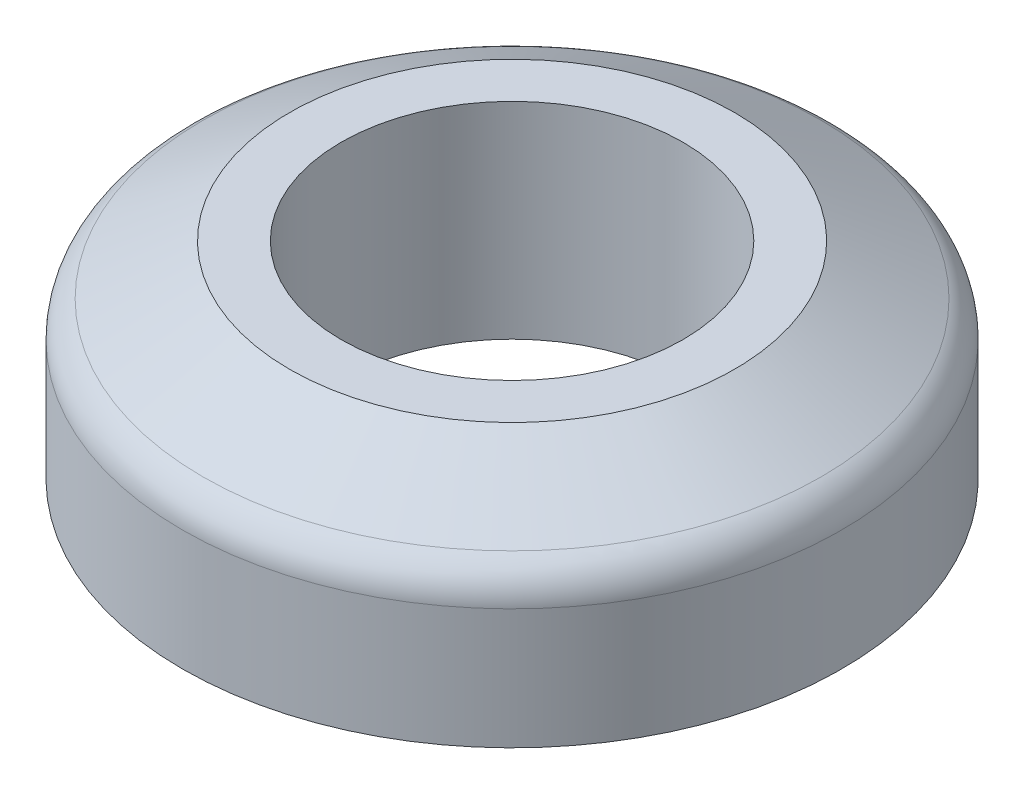
ISO-10303-21;
HEADER;
FILE_DESCRIPTION(('STEP AP214'),'2;1');
FILE_NAME('part.step','',(''),(''),'','','');
FILE_SCHEMA(('AUTOMOTIVE_DESIGN { 1 0 10303 214 1 1 1 1 }'));
ENDSEC;
DATA;
#1=APPLICATION_CONTEXT('core data for automotive mechanical design processes');
#2=APPLICATION_PROTOCOL_DEFINITION('international standard','automotive_design',2000,#1);
#3=PRODUCT_CONTEXT('',#1,'mechanical');
#4=PRODUCT('Part','Part','',(#3));
#5=PRODUCT_RELATED_PRODUCT_CATEGORY('part','',(#4));
#6=PRODUCT_DEFINITION_FORMATION('','',#4);
#7=PRODUCT_DEFINITION_CONTEXT('part definition',#1,'design');
#8=PRODUCT_DEFINITION('design','',#6,#7);
#9=PRODUCT_DEFINITION_SHAPE('','',#8);
#10=(LENGTH_UNIT() NAMED_UNIT(*) SI_UNIT(.MILLI.,.METRE.));
#11=(NAMED_UNIT(*) PLANE_ANGLE_UNIT() SI_UNIT($,.RADIAN.));
#12=(NAMED_UNIT(*) SI_UNIT($,.STERADIAN.) SOLID_ANGLE_UNIT());
#13=UNCERTAINTY_MEASURE_WITH_UNIT(LENGTH_MEASURE(1.E-05),#10,'distance_accuracy_value','');
#14=(GEOMETRIC_REPRESENTATION_CONTEXT(3) GLOBAL_UNCERTAINTY_ASSIGNED_CONTEXT((#13)) GLOBAL_UNIT_ASSIGNED_CONTEXT((#10,
#11,#12)) REPRESENTATION_CONTEXT('',''));
#15=CARTESIAN_POINT('',(0.,0.,0.));
#16=DIRECTION('',(0.,0.,1.));
#17=DIRECTION('',(1.,0.,0.));
#18=AXIS2_PLACEMENT_3D('',#15,#16,#17);
#19=CARTESIAN_POINT('',(0.,5.,0.));
#20=DIRECTION('',(0.,1.,0.));
#21=DIRECTION('',(0.,0.,1.));
#22=AXIS2_PLACEMENT_3D('',#19,#20,#21);
#23=PLANE('',#22);
#24=CARTESIAN_POINT('',(0.,5.,0.));
#25=DIRECTION('',(0.,1.,0.));
#26=DIRECTION('',(0.,0.,1.));
#27=AXIS2_PLACEMENT_3D('',#24,#25,#26);
#28=CIRCLE('',#27,5.39999999999998);
#29=CARTESIAN_POINT('',(0.,5.,5.39999999999998));
#30=VERTEX_POINT('',#29);
#31=EDGE_CURVE('E48',#30,#30,#28,.T.);
#32=ORIENTED_EDGE('',*,*,#31,.T.);
#33=EDGE_LOOP('',(#32));
#34=FACE_BOUND('',#33,.T.);
#35=CARTESIAN_POINT('',(0.,5.,0.));
#36=DIRECTION('',(0.,1.,0.));
#37=DIRECTION('',(0.,0.,1.));
#38=AXIS2_PLACEMENT_3D('',#35,#36,#37);
#39=CIRCLE('',#38,4.15);
#40=CARTESIAN_POINT('',(0.,5.,4.15));
#41=VERTEX_POINT('',#40);
#42=EDGE_CURVE('E57',#41,#41,#39,.T.);
#43=ORIENTED_EDGE('',*,*,#42,.F.);
#44=EDGE_LOOP('',(#43));
#45=FACE_BOUND('',#44,.T.);
#46=ADVANCED_FACE('F37',(#34,#45),#23,.T.);
#47=CARTESIAN_POINT('',(0.,0.,0.));
#48=DIRECTION('',(0.,1.,0.));
#49=DIRECTION('',(0.,0.,1.));
#50=AXIS2_PLACEMENT_3D('',#47,#48,#49);
#51=PLANE('',#50);
#52=CARTESIAN_POINT('',(0.,0.,0.));
#53=DIRECTION('',(0.,1.,0.));
#54=DIRECTION('',(0.,0.,1.));
#55=AXIS2_PLACEMENT_3D('',#52,#53,#54);
#56=CIRCLE('',#55,8.);
#57=CARTESIAN_POINT('',(0.,0.,8.));
#58=VERTEX_POINT('',#57);
#59=EDGE_CURVE('E52',#58,#58,#56,.T.);
#60=ORIENTED_EDGE('',*,*,#59,.F.);
#61=EDGE_LOOP('',(#60));
#62=FACE_BOUND('',#61,.T.);
#63=CARTESIAN_POINT('',(0.,0.,0.));
#64=DIRECTION('',(0.,1.,0.));
#65=DIRECTION('',(0.,0.,1.));
#66=AXIS2_PLACEMENT_3D('',#63,#64,#65);
#67=CIRCLE('',#66,4.15);
#68=CARTESIAN_POINT('',(0.,0.,4.15));
#69=VERTEX_POINT('',#68);
#70=EDGE_CURVE('E58',#69,#69,#67,.T.);
#71=ORIENTED_EDGE('',*,*,#70,.T.);
#72=EDGE_LOOP('',(#71));
#73=FACE_BOUND('',#72,.T.);
#74=ADVANCED_FACE('F68',(#62,#73),#51,.F.);
#75=CARTESIAN_POINT('',(0.,5.,0.));
#76=DIRECTION('',(0.,-1.,0.));
#77=DIRECTION('',(0.,0.,-1.));
#78=AXIS2_PLACEMENT_3D('',#75,#76,#77);
#79=CYLINDRICAL_SURFACE('',#78,8.);
#80=CARTESIAN_POINT('',(0.,2.92153903091734,0.));
#81=DIRECTION('',(0.,1.,0.));
#82=DIRECTION('',(0.,0.,1.));
#83=AXIS2_PLACEMENT_3D('',#80,#81,#82);
#84=CIRCLE('',#83,8.);
#85=CARTESIAN_POINT('',(0.,2.92153903091734,8.));
#86=VERTEX_POINT('',#85);
#87=EDGE_CURVE('E44',#86,#86,#84,.F.);
#88=ORIENTED_EDGE('',*,*,#87,.T.);
#89=EDGE_LOOP('',(#88));
#90=FACE_BOUND('',#89,.T.);
#91=ORIENTED_EDGE('',*,*,#59,.T.);
#92=EDGE_LOOP('',(#91));
#93=FACE_BOUND('',#92,.T.);
#94=ADVANCED_FACE('F74',(#90,#93),#79,.T.);
#95=CARTESIAN_POINT('',(0.,5.,0.));
#96=DIRECTION('',(0.,-1.,0.));
#97=DIRECTION('',(0.,0.,-1.));
#98=AXIS2_PLACEMENT_3D('',#95,#96,#97);
#99=CYLINDRICAL_SURFACE('',#98,4.15);
#100=ORIENTED_EDGE('',*,*,#42,.T.);
#101=EDGE_LOOP('',(#100));
#102=FACE_BOUND('',#101,.T.);
#103=ORIENTED_EDGE('',*,*,#70,.F.);
#104=EDGE_LOOP('',(#103));
#105=FACE_BOUND('',#104,.T.);
#106=ADVANCED_FACE('F64',(#102,#105),#99,.F.);
#107=CARTESIAN_POINT('',(0.,5.,0.));
#108=DIRECTION('',(0.,-1.,0.));
#109=DIRECTION('',(0.,0.,-1.));
#110=AXIS2_PLACEMENT_3D('',#107,#108,#109);
#111=CONICAL_SURFACE('',#110,5.39999999999998,1.0471975511966);
#112=CARTESIAN_POINT('',(0.,3.78756443470178,0.));
#113=DIRECTION('',(0.,-1.,0.));
#114=DIRECTION('',(0.,0.,-1.));
#115=AXIS2_PLACEMENT_3D('',#112,#113,#114);
#116=CIRCLE('',#115,7.5);
#117=CARTESIAN_POINT('',(0.,3.78756443470178,-7.5));
#118=VERTEX_POINT('',#117);
#119=EDGE_CURVE('E10',#118,#118,#116,.F.);
#120=ORIENTED_EDGE('',*,*,#119,.T.);
#121=EDGE_LOOP('',(#120));
#122=FACE_BOUND('',#121,.T.);
#123=ORIENTED_EDGE('',*,*,#31,.F.);
#124=EDGE_LOOP('',(#123));
#125=FACE_BOUND('',#124,.T.);
#126=ADVANCED_FACE('F81',(#122,#125),#111,.T.);
#127=CARTESIAN_POINT('',(0.,2.92153903091734,0.));
#128=DIRECTION('',(0.,1.,0.));
#129=DIRECTION('',(0.,0.,1.));
#130=AXIS2_PLACEMENT_3D('',#127,#128,#129);
#131=TOROIDAL_SURFACE('',#130,7.,1.);
#132=ORIENTED_EDGE('',*,*,#119,.F.);
#133=EDGE_LOOP('',(#132));
#134=FACE_BOUND('',#133,.T.);
#135=ORIENTED_EDGE('',*,*,#87,.F.);
#136=EDGE_LOOP('',(#135));
#137=FACE_BOUND('',#136,.T.);
#138=ADVANCED_FACE('F39',(#134,#137),#131,.T.);
#139=CLOSED_SHELL('',(#46,#74,#94,#106,#126,#138));
#140=MANIFOLD_SOLID_BREP('B2',#139);
#141=ADVANCED_BREP_SHAPE_REPRESENTATION('',(#18,#140),#14);
#142=SHAPE_DEFINITION_REPRESENTATION(#9,#141);
ENDSEC;
END-ISO-10303-21;
